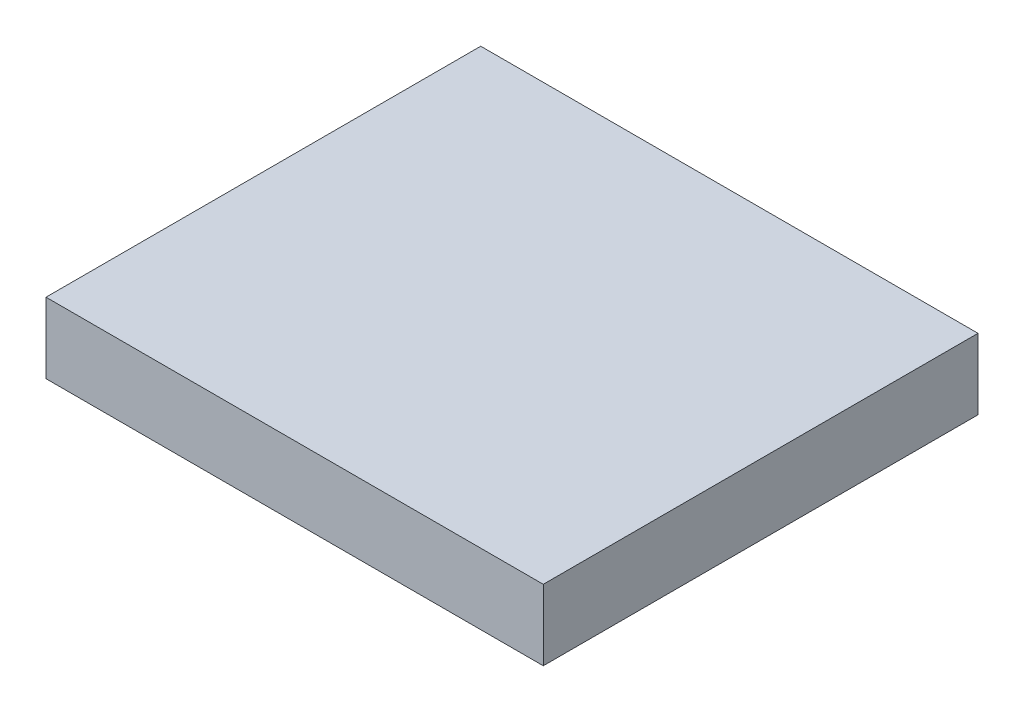
ISO-10303-21;
HEADER;
FILE_DESCRIPTION(('STEP AP214'),'2;1');
FILE_NAME('part.step','',(''),(''),'','','');
FILE_SCHEMA(('AUTOMOTIVE_DESIGN { 1 0 10303 214 1 1 1 1 }'));
ENDSEC;
DATA;
#1=APPLICATION_CONTEXT('core data for automotive mechanical design processes');
#2=APPLICATION_PROTOCOL_DEFINITION('international standard','automotive_design',2000,#1);
#3=PRODUCT_CONTEXT('',#1,'mechanical');
#4=PRODUCT('Part','Part','',(#3));
#5=PRODUCT_RELATED_PRODUCT_CATEGORY('part','',(#4));
#6=PRODUCT_DEFINITION_FORMATION('','',#4);
#7=PRODUCT_DEFINITION_CONTEXT('part definition',#1,'design');
#8=PRODUCT_DEFINITION('design','',#6,#7);
#9=PRODUCT_DEFINITION_SHAPE('','',#8);
#10=(LENGTH_UNIT() NAMED_UNIT(*) SI_UNIT(.MILLI.,.METRE.));
#11=(NAMED_UNIT(*) PLANE_ANGLE_UNIT() SI_UNIT($,.RADIAN.));
#12=(NAMED_UNIT(*) SI_UNIT($,.STERADIAN.) SOLID_ANGLE_UNIT());
#13=UNCERTAINTY_MEASURE_WITH_UNIT(LENGTH_MEASURE(1.E-05),#10,'distance_accuracy_value','');
#14=(GEOMETRIC_REPRESENTATION_CONTEXT(3) GLOBAL_UNCERTAINTY_ASSIGNED_CONTEXT((#13)) GLOBAL_UNIT_ASSIGNED_CONTEXT((#10,
#11,#12)) REPRESENTATION_CONTEXT('',''));
#15=CARTESIAN_POINT('',(0.,0.,0.));
#16=DIRECTION('',(0.,0.,1.));
#17=DIRECTION('',(1.,0.,0.));
#18=AXIS2_PLACEMENT_3D('',#15,#16,#17);
#19=CARTESIAN_POINT('',(10.1981,2.8956,8.9154));
#20=DIRECTION('',(-1.,0.,0.));
#21=DIRECTION('',(0.,0.,1.));
#22=AXIS2_PLACEMENT_3D('',#19,#20,#21);
#23=PLANE('',#22);
#24=DIRECTION('',(0.,0.,-1.));
#25=VECTOR('',#24,1.);
#26=CARTESIAN_POINT('',(10.1981,0.,8.9154));
#27=LINE('',#26,#25);
#28=CARTESIAN_POINT('',(10.1981,0.,8.9154));
#29=VERTEX_POINT('',#28);
#30=CARTESIAN_POINT('',(10.1981,0.,-8.9154));
#31=VERTEX_POINT('',#30);
#32=EDGE_CURVE('E104',#29,#31,#27,.T.);
#33=ORIENTED_EDGE('',*,*,#32,.T.);
#34=DIRECTION('',(0.,-1.,0.));
#35=VECTOR('',#34,1.);
#36=CARTESIAN_POINT('',(10.1981,2.8956,-8.9154));
#37=LINE('',#36,#35);
#38=CARTESIAN_POINT('',(10.1981,2.8956,-8.9154));
#39=VERTEX_POINT('',#38);
#40=EDGE_CURVE('E11',#39,#31,#37,.T.);
#41=ORIENTED_EDGE('',*,*,#40,.F.);
#42=DIRECTION('',(0.,0.,-1.));
#43=VECTOR('',#42,1.);
#44=CARTESIAN_POINT('',(10.1981,2.8956,8.9154));
#45=LINE('',#44,#43);
#46=CARTESIAN_POINT('',(10.1981,2.8956,8.9154));
#47=VERTEX_POINT('',#46);
#48=EDGE_CURVE('E92',#47,#39,#45,.T.);
#49=ORIENTED_EDGE('',*,*,#48,.F.);
#50=DIRECTION('',(0.,-1.,0.));
#51=VECTOR('',#50,1.);
#52=CARTESIAN_POINT('',(10.1981,2.8956,8.9154));
#53=LINE('',#52,#51);
#54=EDGE_CURVE('E100',#47,#29,#53,.T.);
#55=ORIENTED_EDGE('',*,*,#54,.T.);
#56=EDGE_LOOP('',(#33,#41,#49,#55));
#57=FACE_BOUND('',#56,.T.);
#58=ADVANCED_FACE('F41',(#57),#23,.F.);
#59=CARTESIAN_POINT('',(-10.1981,2.8956,-8.9154));
#60=DIRECTION('',(0.,0.,1.));
#61=DIRECTION('',(1.,0.,0.));
#62=AXIS2_PLACEMENT_3D('',#59,#60,#61);
#63=PLANE('',#62);
#64=DIRECTION('',(-1.,0.,0.));
#65=VECTOR('',#64,1.);
#66=CARTESIAN_POINT('',(-10.1981,0.,-8.9154));
#67=LINE('',#66,#65);
#68=CARTESIAN_POINT('',(-10.1981,0.,-8.9154));
#69=VERTEX_POINT('',#68);
#70=EDGE_CURVE('E96',#31,#69,#67,.T.);
#71=ORIENTED_EDGE('',*,*,#70,.T.);
#72=DIRECTION('',(0.,-1.,0.));
#73=VECTOR('',#72,1.);
#74=CARTESIAN_POINT('',(-10.1981,2.8956,-8.9154));
#75=LINE('',#74,#73);
#76=CARTESIAN_POINT('',(-10.1981,2.8956,-8.9154));
#77=VERTEX_POINT('',#76);
#78=EDGE_CURVE('E49',#77,#69,#75,.T.);
#79=ORIENTED_EDGE('',*,*,#78,.F.);
#80=DIRECTION('',(-1.,0.,0.));
#81=VECTOR('',#80,1.);
#82=CARTESIAN_POINT('',(-10.1981,2.8956,-8.9154));
#83=LINE('',#82,#81);
#84=EDGE_CURVE('E87',#39,#77,#83,.T.);
#85=ORIENTED_EDGE('',*,*,#84,.F.);
#86=ORIENTED_EDGE('',*,*,#40,.T.);
#87=EDGE_LOOP('',(#71,#79,#85,#86));
#88=FACE_BOUND('',#87,.T.);
#89=ADVANCED_FACE('F95',(#88),#63,.F.);
#90=CARTESIAN_POINT('',(-10.1981,2.8956,8.9154));
#91=DIRECTION('',(1.,0.,0.));
#92=DIRECTION('',(0.,0.,-1.));
#93=AXIS2_PLACEMENT_3D('',#90,#91,#92);
#94=PLANE('',#93);
#95=DIRECTION('',(0.,0.,1.));
#96=VECTOR('',#95,1.);
#97=CARTESIAN_POINT('',(-10.1981,0.,8.9154));
#98=LINE('',#97,#96);
#99=CARTESIAN_POINT('',(-10.1981,0.,8.9154));
#100=VERTEX_POINT('',#99);
#101=EDGE_CURVE('E74',#69,#100,#98,.T.);
#102=ORIENTED_EDGE('',*,*,#101,.T.);
#103=DIRECTION('',(0.,-1.,0.));
#104=VECTOR('',#103,1.);
#105=CARTESIAN_POINT('',(-10.1981,2.8956,8.9154));
#106=LINE('',#105,#104);
#107=CARTESIAN_POINT('',(-10.1981,2.8956,8.9154));
#108=VERTEX_POINT('',#107);
#109=EDGE_CURVE('E97',#108,#100,#106,.T.);
#110=ORIENTED_EDGE('',*,*,#109,.F.);
#111=DIRECTION('',(0.,0.,1.));
#112=VECTOR('',#111,1.);
#113=CARTESIAN_POINT('',(-10.1981,2.8956,8.9154));
#114=LINE('',#113,#112);
#115=EDGE_CURVE('E90',#77,#108,#114,.T.);
#116=ORIENTED_EDGE('',*,*,#115,.F.);
#117=ORIENTED_EDGE('',*,*,#78,.T.);
#118=EDGE_LOOP('',(#102,#110,#116,#117));
#119=FACE_BOUND('',#118,.T.);
#120=ADVANCED_FACE('F98',(#119),#94,.F.);
#121=CARTESIAN_POINT('',(-10.1981,2.8956,8.9154));
#122=DIRECTION('',(0.,0.,-1.));
#123=DIRECTION('',(-1.,0.,0.));
#124=AXIS2_PLACEMENT_3D('',#121,#122,#123);
#125=PLANE('',#124);
#126=DIRECTION('',(1.,0.,0.));
#127=VECTOR('',#126,1.);
#128=CARTESIAN_POINT('',(-10.1981,0.,8.9154));
#129=LINE('',#128,#127);
#130=EDGE_CURVE('E80',#100,#29,#129,.T.);
#131=ORIENTED_EDGE('',*,*,#130,.T.);
#132=ORIENTED_EDGE('',*,*,#54,.F.);
#133=DIRECTION('',(1.,0.,0.));
#134=VECTOR('',#133,1.);
#135=CARTESIAN_POINT('',(-10.1981,2.8956,8.9154));
#136=LINE('',#135,#134);
#137=EDGE_CURVE('E57',#108,#47,#136,.T.);
#138=ORIENTED_EDGE('',*,*,#137,.F.);
#139=ORIENTED_EDGE('',*,*,#109,.T.);
#140=EDGE_LOOP('',(#131,#132,#138,#139));
#141=FACE_BOUND('',#140,.T.);
#142=ADVANCED_FACE('F111',(#141),#125,.F.);
#143=CARTESIAN_POINT('',(0.,2.8956,0.));
#144=DIRECTION('',(0.,-1.,0.));
#145=DIRECTION('',(0.,0.,-1.));
#146=AXIS2_PLACEMENT_3D('',#143,#144,#145);
#147=PLANE('',#146);
#148=ORIENTED_EDGE('',*,*,#48,.T.);
#149=ORIENTED_EDGE('',*,*,#84,.T.);
#150=ORIENTED_EDGE('',*,*,#115,.T.);
#151=ORIENTED_EDGE('',*,*,#137,.T.);
#152=EDGE_LOOP('',(#148,#149,#150,#151));
#153=FACE_BOUND('',#152,.T.);
#154=ADVANCED_FACE('F88',(#153),#147,.F.);
#155=CARTESIAN_POINT('',(0.,0.,0.));
#156=DIRECTION('',(0.,-1.,0.));
#157=DIRECTION('',(0.,0.,-1.));
#158=AXIS2_PLACEMENT_3D('',#155,#156,#157);
#159=PLANE('',#158);
#160=ORIENTED_EDGE('',*,*,#32,.F.);
#161=ORIENTED_EDGE('',*,*,#130,.F.);
#162=ORIENTED_EDGE('',*,*,#101,.F.);
#163=ORIENTED_EDGE('',*,*,#70,.F.);
#164=EDGE_LOOP('',(#160,#161,#162,#163));
#165=FACE_BOUND('',#164,.T.);
#166=ADVANCED_FACE('F114',(#165),#159,.T.);
#167=CLOSED_SHELL('',(#58,#89,#120,#142,#154,#166));
#168=MANIFOLD_SOLID_BREP('B2',#167);
#169=ADVANCED_BREP_SHAPE_REPRESENTATION('',(#18,#168),#14);
#170=SHAPE_DEFINITION_REPRESENTATION(#9,#169);
ENDSEC;
END-ISO-10303-21;
